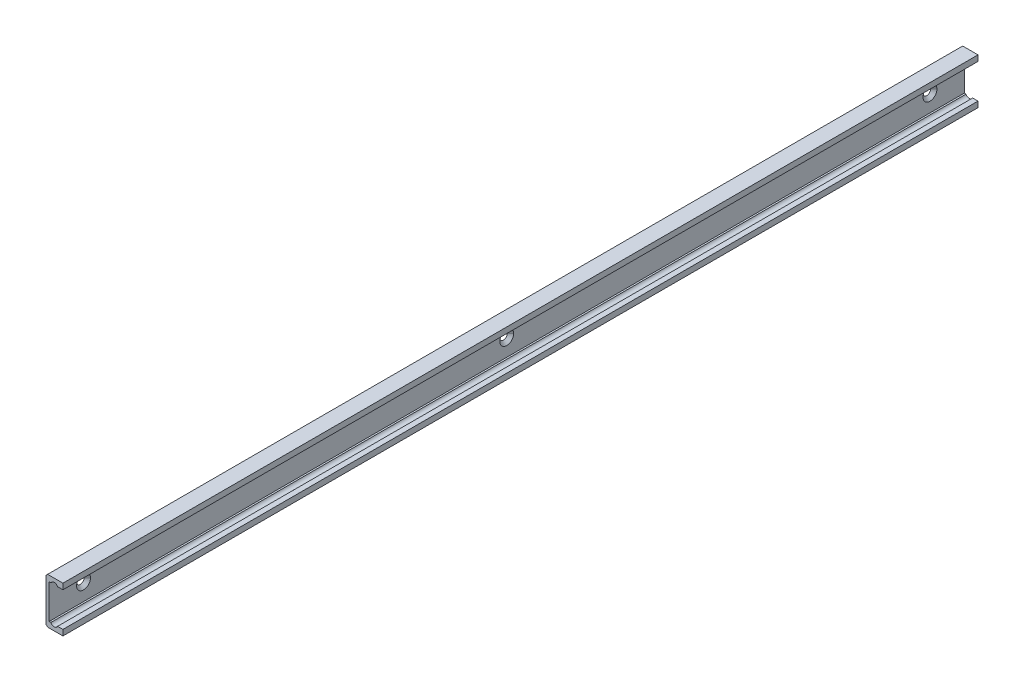
ISO-10303-21;
HEADER;
FILE_DESCRIPTION(('STEP AP214'),'2;1');
FILE_NAME('part.step','',(''),(''),'','','');
FILE_SCHEMA(('AUTOMOTIVE_DESIGN { 1 0 10303 214 1 1 1 1 }'));
ENDSEC;
DATA;
#1=APPLICATION_CONTEXT('core data for automotive mechanical design processes');
#2=APPLICATION_PROTOCOL_DEFINITION('international standard','automotive_design',2000,#1);
#3=PRODUCT_CONTEXT('',#1,'mechanical');
#4=PRODUCT('Part','Part','',(#3));
#5=PRODUCT_RELATED_PRODUCT_CATEGORY('part','',(#4));
#6=PRODUCT_DEFINITION_FORMATION('','',#4);
#7=PRODUCT_DEFINITION_CONTEXT('part definition',#1,'design');
#8=PRODUCT_DEFINITION('design','',#6,#7);
#9=PRODUCT_DEFINITION_SHAPE('','',#8);
#10=(LENGTH_UNIT() NAMED_UNIT(*) SI_UNIT(.MILLI.,.METRE.));
#11=(NAMED_UNIT(*) PLANE_ANGLE_UNIT() SI_UNIT($,.RADIAN.));
#12=(NAMED_UNIT(*) SI_UNIT($,.STERADIAN.) SOLID_ANGLE_UNIT());
#13=UNCERTAINTY_MEASURE_WITH_UNIT(LENGTH_MEASURE(1.E-05),#10,'distance_accuracy_value','');
#14=(GEOMETRIC_REPRESENTATION_CONTEXT(3) GLOBAL_UNCERTAINTY_ASSIGNED_CONTEXT((#13)) GLOBAL_UNIT_ASSIGNED_CONTEXT((#10,
#11,#12)) REPRESENTATION_CONTEXT('',''));
#15=CARTESIAN_POINT('',(0.,0.,0.));
#16=DIRECTION('',(0.,0.,1.));
#17=DIRECTION('',(1.,0.,0.));
#18=AXIS2_PLACEMENT_3D('',#15,#16,#17);
#19=CARTESIAN_POINT('',(-2.3334990623938,17.5,400.));
#20=DIRECTION('',(0.,1.,0.));
#21=DIRECTION('',(0.,0.,1.));
#22=AXIS2_PLACEMENT_3D('',#19,#20,#21);
#23=PLANE('',#22);
#24=DIRECTION('',(1.,0.,0.));
#25=VECTOR('',#24,1.);
#26=CARTESIAN_POINT('',(-2.3334990623938,17.5,0.));
#27=LINE('',#26,#25);
#28=CARTESIAN_POINT('',(-2.3334990623938,17.5,0.));
#29=VERTEX_POINT('',#28);
#30=CARTESIAN_POINT('',(0.,17.5,0.));
#31=VERTEX_POINT('',#30);
#32=EDGE_CURVE('E11',#29,#31,#27,.T.);
#33=ORIENTED_EDGE('',*,*,#32,.T.);
#34=DIRECTION('',(0.,0.,-1.));
#35=VECTOR('',#34,1.);
#36=CARTESIAN_POINT('',(0.,17.5,400.));
#37=LINE('',#36,#35);
#38=CARTESIAN_POINT('',(0.,17.5,400.));
#39=VERTEX_POINT('',#38);
#40=EDGE_CURVE('E25',#39,#31,#37,.T.);
#41=ORIENTED_EDGE('',*,*,#40,.F.);
#42=DIRECTION('',(1.,0.,0.));
#43=VECTOR('',#42,1.);
#44=CARTESIAN_POINT('',(-2.3334990623938,17.5,400.));
#45=LINE('',#44,#43);
#46=CARTESIAN_POINT('',(-2.3334990623938,17.5,400.));
#47=VERTEX_POINT('',#46);
#48=EDGE_CURVE('E373',#47,#39,#45,.T.);
#49=ORIENTED_EDGE('',*,*,#48,.F.);
#50=DIRECTION('',(0.,0.,-1.));
#51=VECTOR('',#50,1.);
#52=CARTESIAN_POINT('',(-2.3334990623938,17.5,400.));
#53=LINE('',#52,#51);
#54=EDGE_CURVE('E369',#47,#29,#53,.T.);
#55=ORIENTED_EDGE('',*,*,#54,.T.);
#56=EDGE_LOOP('',(#33,#41,#49,#55));
#57=FACE_BOUND('',#56,.T.);
#58=ADVANCED_FACE('F17',(#57),#23,.F.);
#59=CARTESIAN_POINT('',(-3.8,16.8000000000001,400.));
#60=DIRECTION('',(0.,0.,1.));
#61=DIRECTION('',(0.,-1.,0.));
#62=AXIS2_PLACEMENT_3D('',#59,#60,#61);
#63=CYLINDRICAL_SURFACE('',#62,1.625);
#64=DIRECTION('',(0.,0.,-1.));
#65=VECTOR('',#64,1.);
#66=CARTESIAN_POINT('',(-5.2665009376062,17.5,400.));
#67=LINE('',#66,#65);
#68=CARTESIAN_POINT('',(-5.2665009376062,17.5,400.));
#69=VERTEX_POINT('',#68);
#70=CARTESIAN_POINT('',(-5.2665009376062,17.5,0.));
#71=VERTEX_POINT('',#70);
#72=EDGE_CURVE('E365',#69,#71,#67,.T.);
#73=ORIENTED_EDGE('',*,*,#72,.T.);
#74=CARTESIAN_POINT('',(-3.8,16.8000000000001,0.));
#75=DIRECTION('',(0.,0.,1.));
#76=DIRECTION('',(1.,0.,0.));
#77=AXIS2_PLACEMENT_3D('',#74,#75,#76);
#78=CIRCLE('',#77,1.625);
#79=EDGE_CURVE('E360',#29,#71,#78,.T.);
#80=ORIENTED_EDGE('',*,*,#79,.F.);
#81=ORIENTED_EDGE('',*,*,#54,.F.);
#82=CARTESIAN_POINT('',(-3.8,16.8000000000001,400.));
#83=DIRECTION('',(0.,0.,1.));
#84=DIRECTION('',(1.,0.,0.));
#85=AXIS2_PLACEMENT_3D('',#82,#83,#84);
#86=CIRCLE('',#85,1.625);
#87=EDGE_CURVE('E356',#47,#69,#86,.T.);
#88=ORIENTED_EDGE('',*,*,#87,.T.);
#89=EDGE_LOOP('',(#73,#80,#81,#88));
#90=FACE_BOUND('',#89,.T.);
#91=ADVANCED_FACE('F458',(#90),#63,.F.);
#92=CARTESIAN_POINT('',(-3.8,3.19999999999993,400.));
#93=DIRECTION('',(0.,0.,1.));
#94=DIRECTION('',(1.,0.,0.));
#95=AXIS2_PLACEMENT_3D('',#92,#93,#94);
#96=PLANE('',#95);
#97=DIRECTION('',(0.,-1.,0.));
#98=VECTOR('',#97,1.);
#99=CARTESIAN_POINT('',(-7.4,19.292893218813,400.));
#100=LINE('',#99,#98);
#101=CARTESIAN_POINT('',(-7.4,19.292893218813,400.));
#102=VERTEX_POINT('',#101);
#103=CARTESIAN_POINT('',(-7.4,0.70710678118655,400.));
#104=VERTEX_POINT('',#103);
#105=EDGE_CURVE('E352',#102,#104,#100,.T.);
#106=ORIENTED_EDGE('',*,*,#105,.T.);
#107=DIRECTION('',(0.707106781186522,-0.707106781186573,0.));
#108=VECTOR('',#107,1.);
#109=CARTESIAN_POINT('',(-7.4,0.70710678118655,400.));
#110=LINE('',#109,#108);
#111=CARTESIAN_POINT('',(-6.6928932188135,0.,400.));
#112=VERTEX_POINT('',#111);
#113=EDGE_CURVE('E348',#104,#112,#110,.T.);
#114=ORIENTED_EDGE('',*,*,#113,.T.);
#115=DIRECTION('',(1.,0.,0.));
#116=VECTOR('',#115,1.);
#117=CARTESIAN_POINT('',(-6.6928932188135,0.,400.));
#118=LINE('',#117,#116);
#119=CARTESIAN_POINT('',(0.,0.,400.));
#120=VERTEX_POINT('',#119);
#121=EDGE_CURVE('E344',#112,#120,#118,.T.);
#122=ORIENTED_EDGE('',*,*,#121,.T.);
#123=DIRECTION('',(0.,1.,0.));
#124=VECTOR('',#123,1.);
#125=CARTESIAN_POINT('',(0.,0.,400.));
#126=LINE('',#125,#124);
#127=CARTESIAN_POINT('',(0.,2.5,400.));
#128=VERTEX_POINT('',#127);
#129=EDGE_CURVE('E340',#120,#128,#126,.T.);
#130=ORIENTED_EDGE('',*,*,#129,.T.);
#131=DIRECTION('',(-1.,0.,0.));
#132=VECTOR('',#131,1.);
#133=CARTESIAN_POINT('',(0.,2.5,400.));
#134=LINE('',#133,#132);
#135=CARTESIAN_POINT('',(-2.3334990623938,2.5,400.));
#136=VERTEX_POINT('',#135);
#137=EDGE_CURVE('E336',#128,#136,#134,.T.);
#138=ORIENTED_EDGE('',*,*,#137,.T.);
#139=CARTESIAN_POINT('',(-3.8,3.19999999999993,400.));
#140=DIRECTION('',(0.,0.,1.));
#141=DIRECTION('',(1.,0.,0.));
#142=AXIS2_PLACEMENT_3D('',#139,#140,#141);
#143=CIRCLE('',#142,1.625);
#144=CARTESIAN_POINT('',(-5.2665009376062,2.5,400.));
#145=VERTEX_POINT('',#144);
#146=EDGE_CURVE('E331',#145,#136,#143,.T.);
#147=ORIENTED_EDGE('',*,*,#146,.F.);
#148=DIRECTION('',(-1.,0.,0.));
#149=VECTOR('',#148,1.);
#150=CARTESIAN_POINT('',(-5.2665009376062,2.5,400.));
#151=LINE('',#150,#149);
#152=CARTESIAN_POINT('',(-6.,2.5,400.));
#153=VERTEX_POINT('',#152);
#154=EDGE_CURVE('E327',#145,#153,#151,.T.);
#155=ORIENTED_EDGE('',*,*,#154,.T.);
#156=DIRECTION('',(0.,1.,0.));
#157=VECTOR('',#156,1.);
#158=CARTESIAN_POINT('',(-6.,2.5,400.));
#159=LINE('',#158,#157);
#160=CARTESIAN_POINT('',(-6.,17.5,400.));
#161=VERTEX_POINT('',#160);
#162=EDGE_CURVE('E323',#153,#161,#159,.T.);
#163=ORIENTED_EDGE('',*,*,#162,.T.);
#164=DIRECTION('',(1.,0.,0.));
#165=VECTOR('',#164,1.);
#166=CARTESIAN_POINT('',(-6.,17.5,400.));
#167=LINE('',#166,#165);
#168=EDGE_CURVE('E318',#161,#69,#167,.T.);
#169=ORIENTED_EDGE('',*,*,#168,.T.);
#170=ORIENTED_EDGE('',*,*,#87,.F.);
#171=ORIENTED_EDGE('',*,*,#48,.T.);
#172=DIRECTION('',(0.,1.,0.));
#173=VECTOR('',#172,1.);
#174=CARTESIAN_POINT('',(0.,17.5,400.));
#175=LINE('',#174,#173);
#176=CARTESIAN_POINT('',(0.,20.,400.));
#177=VERTEX_POINT('',#176);
#178=EDGE_CURVE('E314',#39,#177,#175,.T.);
#179=ORIENTED_EDGE('',*,*,#178,.T.);
#180=DIRECTION('',(-1.,0.,0.));
#181=VECTOR('',#180,1.);
#182=CARTESIAN_POINT('',(0.,20.,400.));
#183=LINE('',#182,#181);
#184=CARTESIAN_POINT('',(-6.6928932188135,20.,400.));
#185=VERTEX_POINT('',#184);
#186=EDGE_CURVE('E310',#177,#185,#183,.T.);
#187=ORIENTED_EDGE('',*,*,#186,.T.);
#188=DIRECTION('',(-0.707106781186298,-0.707106781186797,0.));
#189=VECTOR('',#188,1.);
#190=CARTESIAN_POINT('',(-6.6928932188135,20.,400.));
#191=LINE('',#190,#189);
#192=EDGE_CURVE('E306',#185,#102,#191,.T.);
#193=ORIENTED_EDGE('',*,*,#192,.T.);
#194=EDGE_LOOP('',(#106,#114,#122,#130,#138,#147,#155,#163,#169,#170,#171,#179,#187,#193));
#195=FACE_BOUND('',#194,.T.);
#196=ADVANCED_FACE('F397',(#195),#96,.T.);
#197=CARTESIAN_POINT('',(-6.6928932188135,20.,400.));
#198=DIRECTION('',(0.707106781186797,-0.707106781186298,0.));
#199=DIRECTION('',(0.707106781186298,0.707106781186797,0.));
#200=AXIS2_PLACEMENT_3D('',#197,#198,#199);
#201=PLANE('',#200);
#202=DIRECTION('',(-0.707106781186298,-0.707106781186797,0.));
#203=VECTOR('',#202,1.);
#204=CARTESIAN_POINT('',(-6.6928932188135,20.,0.));
#205=LINE('',#204,#203);
#206=CARTESIAN_POINT('',(-6.6928932188135,20.,0.));
#207=VERTEX_POINT('',#206);
#208=CARTESIAN_POINT('',(-7.4,19.292893218813,0.));
#209=VERTEX_POINT('',#208);
#210=EDGE_CURVE('E302',#207,#209,#205,.T.);
#211=ORIENTED_EDGE('',*,*,#210,.T.);
#212=DIRECTION('',(0.,0.,-1.));
#213=VECTOR('',#212,1.);
#214=CARTESIAN_POINT('',(-7.4,19.292893218813,400.));
#215=LINE('',#214,#213);
#216=EDGE_CURVE('E297',#102,#209,#215,.T.);
#217=ORIENTED_EDGE('',*,*,#216,.F.);
#218=ORIENTED_EDGE('',*,*,#192,.F.);
#219=DIRECTION('',(0.,0.,-1.));
#220=VECTOR('',#219,1.);
#221=CARTESIAN_POINT('',(-6.6928932188135,20.,400.));
#222=LINE('',#221,#220);
#223=EDGE_CURVE('E293',#185,#207,#222,.T.);
#224=ORIENTED_EDGE('',*,*,#223,.T.);
#225=EDGE_LOOP('',(#211,#217,#218,#224));
#226=FACE_BOUND('',#225,.T.);
#227=ADVANCED_FACE('F400',(#226),#201,.F.);
#228=CARTESIAN_POINT('',(0.,20.,400.));
#229=DIRECTION('',(0.,-1.,0.));
#230=DIRECTION('',(0.,0.,-1.));
#231=AXIS2_PLACEMENT_3D('',#228,#229,#230);
#232=PLANE('',#231);
#233=DIRECTION('',(-1.,0.,0.));
#234=VECTOR('',#233,1.);
#235=CARTESIAN_POINT('',(0.,20.,0.));
#236=LINE('',#235,#234);
#237=CARTESIAN_POINT('',(0.,20.,0.));
#238=VERTEX_POINT('',#237);
#239=EDGE_CURVE('E288',#238,#207,#236,.T.);
#240=ORIENTED_EDGE('',*,*,#239,.T.);
#241=ORIENTED_EDGE('',*,*,#223,.F.);
#242=ORIENTED_EDGE('',*,*,#186,.F.);
#243=DIRECTION('',(0.,0.,-1.));
#244=VECTOR('',#243,1.);
#245=CARTESIAN_POINT('',(0.,20.,400.));
#246=LINE('',#245,#244);
#247=EDGE_CURVE('E284',#177,#238,#246,.T.);
#248=ORIENTED_EDGE('',*,*,#247,.T.);
#249=EDGE_LOOP('',(#240,#241,#242,#248));
#250=FACE_BOUND('',#249,.T.);
#251=ADVANCED_FACE('F393',(#250),#232,.F.);
#252=CARTESIAN_POINT('',(0.,17.5,400.));
#253=DIRECTION('',(-1.,0.,0.));
#254=DIRECTION('',(0.,0.,1.));
#255=AXIS2_PLACEMENT_3D('',#252,#253,#254);
#256=PLANE('',#255);
#257=DIRECTION('',(0.,1.,0.));
#258=VECTOR('',#257,1.);
#259=CARTESIAN_POINT('',(0.,17.5,0.));
#260=LINE('',#259,#258);
#261=EDGE_CURVE('E279',#31,#238,#260,.T.);
#262=ORIENTED_EDGE('',*,*,#261,.T.);
#263=ORIENTED_EDGE('',*,*,#247,.F.);
#264=ORIENTED_EDGE('',*,*,#178,.F.);
#265=ORIENTED_EDGE('',*,*,#40,.T.);
#266=EDGE_LOOP('',(#262,#263,#264,#265));
#267=FACE_BOUND('',#266,.T.);
#268=ADVANCED_FACE('F384',(#267),#256,.F.);
#269=CARTESIAN_POINT('',(-3.8,3.19999999999993,0.));
#270=DIRECTION('',(0.,0.,1.));
#271=DIRECTION('',(1.,0.,0.));
#272=AXIS2_PLACEMENT_3D('',#269,#270,#271);
#273=PLANE('',#272);
#274=DIRECTION('',(0.,-1.,0.));
#275=VECTOR('',#274,1.);
#276=CARTESIAN_POINT('',(-7.4,19.292893218813,0.));
#277=LINE('',#276,#275);
#278=CARTESIAN_POINT('',(-7.4,0.70710678118655,0.));
#279=VERTEX_POINT('',#278);
#280=EDGE_CURVE('E274',#209,#279,#277,.T.);
#281=ORIENTED_EDGE('',*,*,#280,.F.);
#282=ORIENTED_EDGE('',*,*,#210,.F.);
#283=ORIENTED_EDGE('',*,*,#239,.F.);
#284=ORIENTED_EDGE('',*,*,#261,.F.);
#285=ORIENTED_EDGE('',*,*,#32,.F.);
#286=ORIENTED_EDGE('',*,*,#79,.T.);
#287=DIRECTION('',(1.,0.,0.));
#288=VECTOR('',#287,1.);
#289=CARTESIAN_POINT('',(-6.,17.5,0.));
#290=LINE('',#289,#288);
#291=CARTESIAN_POINT('',(-6.,17.5,0.));
#292=VERTEX_POINT('',#291);
#293=EDGE_CURVE('E269',#292,#71,#290,.T.);
#294=ORIENTED_EDGE('',*,*,#293,.F.);
#295=DIRECTION('',(0.,1.,0.));
#296=VECTOR('',#295,1.);
#297=CARTESIAN_POINT('',(-6.,2.5,0.));
#298=LINE('',#297,#296);
#299=CARTESIAN_POINT('',(-6.,2.5,0.));
#300=VERTEX_POINT('',#299);
#301=EDGE_CURVE('E264',#300,#292,#298,.T.);
#302=ORIENTED_EDGE('',*,*,#301,.F.);
#303=DIRECTION('',(-1.,0.,0.));
#304=VECTOR('',#303,1.);
#305=CARTESIAN_POINT('',(-5.2665009376062,2.5,0.));
#306=LINE('',#305,#304);
#307=CARTESIAN_POINT('',(-5.2665009376062,2.5,0.));
#308=VERTEX_POINT('',#307);
#309=EDGE_CURVE('E259',#308,#300,#306,.T.);
#310=ORIENTED_EDGE('',*,*,#309,.F.);
#311=CARTESIAN_POINT('',(-3.8,3.19999999999993,0.));
#312=DIRECTION('',(0.,0.,1.));
#313=DIRECTION('',(1.,0.,0.));
#314=AXIS2_PLACEMENT_3D('',#311,#312,#313);
#315=CIRCLE('',#314,1.625);
#316=CARTESIAN_POINT('',(-2.3334990623938,2.5,0.));
#317=VERTEX_POINT('',#316);
#318=EDGE_CURVE('E255',#308,#317,#315,.T.);
#319=ORIENTED_EDGE('',*,*,#318,.T.);
#320=DIRECTION('',(-1.,0.,0.));
#321=VECTOR('',#320,1.);
#322=CARTESIAN_POINT('',(0.,2.5,0.));
#323=LINE('',#322,#321);
#324=CARTESIAN_POINT('',(0.,2.5,0.));
#325=VERTEX_POINT('',#324);
#326=EDGE_CURVE('E250',#325,#317,#323,.T.);
#327=ORIENTED_EDGE('',*,*,#326,.F.);
#328=DIRECTION('',(0.,1.,0.));
#329=VECTOR('',#328,1.);
#330=CARTESIAN_POINT('',(0.,0.,0.));
#331=LINE('',#330,#329);
#332=CARTESIAN_POINT('',(0.,0.,0.));
#333=VERTEX_POINT('',#332);
#334=EDGE_CURVE('E245',#333,#325,#331,.T.);
#335=ORIENTED_EDGE('',*,*,#334,.F.);
#336=DIRECTION('',(1.,0.,0.));
#337=VECTOR('',#336,1.);
#338=CARTESIAN_POINT('',(-6.6928932188135,0.,0.));
#339=LINE('',#338,#337);
#340=CARTESIAN_POINT('',(-6.6928932188135,0.,0.));
#341=VERTEX_POINT('',#340);
#342=EDGE_CURVE('E240',#341,#333,#339,.T.);
#343=ORIENTED_EDGE('',*,*,#342,.F.);
#344=DIRECTION('',(0.707106781186522,-0.707106781186573,0.));
#345=VECTOR('',#344,1.);
#346=CARTESIAN_POINT('',(-7.4,0.70710678118655,0.));
#347=LINE('',#346,#345);
#348=EDGE_CURVE('E235',#279,#341,#347,.T.);
#349=ORIENTED_EDGE('',*,*,#348,.F.);
#350=EDGE_LOOP('',(#281,#282,#283,#284,#285,#286,#294,#302,#310,#319,#327,#335,#343,#349));
#351=FACE_BOUND('',#350,.T.);
#352=ADVANCED_FACE('F389',(#351),#273,.F.);
#353=CARTESIAN_POINT('',(-7.4,0.70710678118655,400.));
#354=DIRECTION('',(0.707106781186573,0.707106781186522,0.));
#355=DIRECTION('',(-0.707106781186522,0.707106781186573,0.));
#356=AXIS2_PLACEMENT_3D('',#353,#354,#355);
#357=PLANE('',#356);
#358=ORIENTED_EDGE('',*,*,#348,.T.);
#359=DIRECTION('',(0.,0.,-1.));
#360=VECTOR('',#359,1.);
#361=CARTESIAN_POINT('',(-6.6928932188135,0.,400.));
#362=LINE('',#361,#360);
#363=EDGE_CURVE('E230',#112,#341,#362,.T.);
#364=ORIENTED_EDGE('',*,*,#363,.F.);
#365=ORIENTED_EDGE('',*,*,#113,.F.);
#366=DIRECTION('',(0.,0.,-1.));
#367=VECTOR('',#366,1.);
#368=CARTESIAN_POINT('',(-7.4,0.70710678118655,400.));
#369=LINE('',#368,#367);
#370=EDGE_CURVE('E225',#104,#279,#369,.T.);
#371=ORIENTED_EDGE('',*,*,#370,.T.);
#372=EDGE_LOOP('',(#358,#364,#365,#371));
#373=FACE_BOUND('',#372,.T.);
#374=ADVANCED_FACE('F408',(#373),#357,.F.);
#375=CARTESIAN_POINT('',(-7.4,19.292893218813,400.));
#376=DIRECTION('',(1.,0.,0.));
#377=DIRECTION('',(0.,0.,-1.));
#378=AXIS2_PLACEMENT_3D('',#375,#376,#377);
#379=PLANE('',#378);
#380=CARTESIAN_POINT('',(-7.4,10.,385.));
#381=DIRECTION('',(1.,0.,0.));
#382=DIRECTION('',(0.,0.,-1.));
#383=AXIS2_PLACEMENT_3D('',#380,#381,#382);
#384=CIRCLE('',#383,1.65);
#385=CARTESIAN_POINT('',(-7.4,10.,383.35));
#386=VERTEX_POINT('',#385);
#387=CARTESIAN_POINT('',(-7.40000000000001,10.,386.65));
#388=VERTEX_POINT('',#387);
#389=EDGE_CURVE('E221',#386,#388,#384,.T.);
#390=ORIENTED_EDGE('',*,*,#389,.T.);
#391=CARTESIAN_POINT('',(-7.4,10.,385.));
#392=DIRECTION('',(1.,0.,0.));
#393=DIRECTION('',(0.,0.,-1.));
#394=AXIS2_PLACEMENT_3D('',#391,#392,#393);
#395=CIRCLE('',#394,1.65);
#396=EDGE_CURVE('E217',#388,#386,#395,.T.);
#397=ORIENTED_EDGE('',*,*,#396,.T.);
#398=EDGE_LOOP('',(#390,#397));
#399=FACE_BOUND('',#398,.T.);
#400=CARTESIAN_POINT('',(-7.4,10.,200.));
#401=DIRECTION('',(1.,0.,0.));
#402=DIRECTION('',(0.,0.,-1.));
#403=AXIS2_PLACEMENT_3D('',#400,#401,#402);
#404=CIRCLE('',#403,1.65);
#405=CARTESIAN_POINT('',(-7.4,10.,198.35));
#406=VERTEX_POINT('',#405);
#407=CARTESIAN_POINT('',(-7.4,10.,201.65));
#408=VERTEX_POINT('',#407);
#409=EDGE_CURVE('E213',#406,#408,#404,.T.);
#410=ORIENTED_EDGE('',*,*,#409,.T.);
#411=CARTESIAN_POINT('',(-7.4,10.,200.));
#412=DIRECTION('',(1.,0.,0.));
#413=DIRECTION('',(0.,0.,-1.));
#414=AXIS2_PLACEMENT_3D('',#411,#412,#413);
#415=CIRCLE('',#414,1.65);
#416=EDGE_CURVE('E163',#408,#406,#415,.T.);
#417=ORIENTED_EDGE('',*,*,#416,.T.);
#418=EDGE_LOOP('',(#410,#417));
#419=FACE_BOUND('',#418,.T.);
#420=CARTESIAN_POINT('',(-7.4,10.,15.));
#421=DIRECTION('',(1.,0.,0.));
#422=DIRECTION('',(0.,0.,-1.));
#423=AXIS2_PLACEMENT_3D('',#420,#421,#422);
#424=CIRCLE('',#423,1.65);
#425=CARTESIAN_POINT('',(-7.4,10.,13.35));
#426=VERTEX_POINT('',#425);
#427=CARTESIAN_POINT('',(-7.4,10.,16.65));
#428=VERTEX_POINT('',#427);
#429=EDGE_CURVE('E206',#426,#428,#424,.T.);
#430=ORIENTED_EDGE('',*,*,#429,.T.);
#431=CARTESIAN_POINT('',(-7.4,10.,15.));
#432=DIRECTION('',(1.,0.,0.));
#433=DIRECTION('',(0.,0.,-1.));
#434=AXIS2_PLACEMENT_3D('',#431,#432,#433);
#435=CIRCLE('',#434,1.65);
#436=EDGE_CURVE('E202',#428,#426,#435,.T.);
#437=ORIENTED_EDGE('',*,*,#436,.T.);
#438=EDGE_LOOP('',(#430,#437));
#439=FACE_BOUND('',#438,.T.);
#440=ORIENTED_EDGE('',*,*,#280,.T.);
#441=ORIENTED_EDGE('',*,*,#370,.F.);
#442=ORIENTED_EDGE('',*,*,#105,.F.);
#443=ORIENTED_EDGE('',*,*,#216,.T.);
#444=EDGE_LOOP('',(#440,#441,#442,#443));
#445=FACE_BOUND('',#444,.T.);
#446=ADVANCED_FACE('F404',(#399,#419,#439,#445),#379,.F.);
#447=CARTESIAN_POINT('',(-7.4,10.,15.));
#448=DIRECTION('',(1.,0.,0.));
#449=DIRECTION('',(0.,1.,0.));
#450=AXIS2_PLACEMENT_3D('',#447,#448,#449);
#451=CONICAL_SURFACE('',#450,1.65,0.7853981634);
#452=ORIENTED_EDGE('',*,*,#436,.F.);
#453=DIRECTION('',(0.707106781184743,0.,0.707106781188352));
#454=VECTOR('',#453,1.);
#455=CARTESIAN_POINT('',(-7.4,10.,16.65));
#456=LINE('',#455,#454);
#457=CARTESIAN_POINT('',(-6.00000000000357,10.,18.0500000000036));
#458=VERTEX_POINT('',#457);
#459=EDGE_CURVE('E198',#428,#458,#456,.T.);
#460=ORIENTED_EDGE('',*,*,#459,.T.);
#461=CARTESIAN_POINT('',(-6.,10.,15.));
#462=DIRECTION('',(1.,0.,0.));
#463=DIRECTION('',(0.,0.,-1.));
#464=AXIS2_PLACEMENT_3D('',#461,#462,#463);
#465=CIRCLE('',#464,3.05);
#466=CARTESIAN_POINT('',(-6.,10.,11.95));
#467=VERTEX_POINT('',#466);
#468=EDGE_CURVE('E194',#458,#467,#465,.T.);
#469=ORIENTED_EDGE('',*,*,#468,.T.);
#470=DIRECTION('',(0.707106781184743,0.,-0.707106781188352));
#471=VECTOR('',#470,1.);
#472=CARTESIAN_POINT('',(-7.4,10.,13.35));
#473=LINE('',#472,#471);
#474=EDGE_CURVE('E189',#426,#467,#473,.T.);
#475=ORIENTED_EDGE('',*,*,#474,.F.);
#476=EDGE_LOOP('',(#452,#460,#469,#475));
#477=FACE_BOUND('',#476,.T.);
#478=ADVANCED_FACE('F499',(#477),#451,.F.);
#479=CARTESIAN_POINT('',(-7.4,10.,15.));
#480=DIRECTION('',(1.,0.,0.));
#481=DIRECTION('',(0.,-1.,0.));
#482=AXIS2_PLACEMENT_3D('',#479,#480,#481);
#483=CONICAL_SURFACE('',#482,1.65,0.7853981634);
#484=CARTESIAN_POINT('',(-6.,10.,15.));
#485=DIRECTION('',(1.,0.,0.));
#486=DIRECTION('',(0.,0.,-1.));
#487=AXIS2_PLACEMENT_3D('',#484,#485,#486);
#488=CIRCLE('',#487,3.05);
#489=EDGE_CURVE('E184',#467,#458,#488,.T.);
#490=ORIENTED_EDGE('',*,*,#489,.T.);
#491=ORIENTED_EDGE('',*,*,#459,.F.);
#492=ORIENTED_EDGE('',*,*,#429,.F.);
#493=ORIENTED_EDGE('',*,*,#474,.T.);
#494=EDGE_LOOP('',(#490,#491,#492,#493));
#495=FACE_BOUND('',#494,.T.);
#496=ADVANCED_FACE('F503',(#495),#483,.F.);
#497=CARTESIAN_POINT('',(-6.,2.5,400.));
#498=DIRECTION('',(-1.,0.,0.));
#499=DIRECTION('',(0.,0.,1.));
#500=AXIS2_PLACEMENT_3D('',#497,#498,#499);
#501=PLANE('',#500);
#502=CARTESIAN_POINT('',(-6.,10.,385.));
#503=DIRECTION('',(1.,0.,0.));
#504=DIRECTION('',(0.,0.,-1.));
#505=AXIS2_PLACEMENT_3D('',#502,#503,#504);
#506=CIRCLE('',#505,3.05);
#507=CARTESIAN_POINT('',(-6.,10.,381.95));
#508=VERTEX_POINT('',#507);
#509=CARTESIAN_POINT('',(-6.00000000000357,10.,388.050000000004));
#510=VERTEX_POINT('',#509);
#511=EDGE_CURVE('E173',#508,#510,#506,.T.);
#512=ORIENTED_EDGE('',*,*,#511,.F.);
#513=CARTESIAN_POINT('',(-6.,10.,385.));
#514=DIRECTION('',(1.,0.,0.));
#515=DIRECTION('',(0.,0.,-1.));
#516=AXIS2_PLACEMENT_3D('',#513,#514,#515);
#517=CIRCLE('',#516,3.05);
#518=EDGE_CURVE('E170',#510,#508,#517,.T.);
#519=ORIENTED_EDGE('',*,*,#518,.F.);
#520=EDGE_LOOP('',(#512,#519));
#521=FACE_BOUND('',#520,.T.);
#522=CARTESIAN_POINT('',(-6.,10.,200.));
#523=DIRECTION('',(1.,0.,0.));
#524=DIRECTION('',(0.,0.,-1.));
#525=AXIS2_PLACEMENT_3D('',#522,#523,#524);
#526=CIRCLE('',#525,3.05);
#527=CARTESIAN_POINT('',(-6.,10.,196.95));
#528=VERTEX_POINT('',#527);
#529=CARTESIAN_POINT('',(-6.00000000000357,10.,203.050000000004));
#530=VERTEX_POINT('',#529);
#531=EDGE_CURVE('E153',#528,#530,#526,.T.);
#532=ORIENTED_EDGE('',*,*,#531,.F.);
#533=CARTESIAN_POINT('',(-6.,10.,200.));
#534=DIRECTION('',(1.,0.,0.));
#535=DIRECTION('',(0.,0.,-1.));
#536=AXIS2_PLACEMENT_3D('',#533,#534,#535);
#537=CIRCLE('',#536,3.05);
#538=EDGE_CURVE('E148',#530,#528,#537,.T.);
#539=ORIENTED_EDGE('',*,*,#538,.F.);
#540=EDGE_LOOP('',(#532,#539));
#541=FACE_BOUND('',#540,.T.);
#542=ORIENTED_EDGE('',*,*,#489,.F.);
#543=ORIENTED_EDGE('',*,*,#468,.F.);
#544=EDGE_LOOP('',(#542,#543));
#545=FACE_BOUND('',#544,.T.);
#546=ORIENTED_EDGE('',*,*,#301,.T.);
#547=DIRECTION('',(0.,0.,-1.));
#548=VECTOR('',#547,1.);
#549=CARTESIAN_POINT('',(-6.,17.5,400.));
#550=LINE('',#549,#548);
#551=EDGE_CURVE('E157',#161,#292,#550,.T.);
#552=ORIENTED_EDGE('',*,*,#551,.F.);
#553=ORIENTED_EDGE('',*,*,#162,.F.);
#554=DIRECTION('',(0.,0.,-1.));
#555=VECTOR('',#554,1.);
#556=CARTESIAN_POINT('',(-6.,2.5,400.));
#557=LINE('',#556,#555);
#558=EDGE_CURVE('E437',#153,#300,#557,.T.);
#559=ORIENTED_EDGE('',*,*,#558,.T.);
#560=EDGE_LOOP('',(#546,#552,#553,#559));
#561=FACE_BOUND('',#560,.T.);
#562=ADVANCED_FACE('F150',(#521,#541,#545,#561),#501,.F.);
#563=CARTESIAN_POINT('',(-5.2665009376062,2.5,400.));
#564=DIRECTION('',(0.,-1.,0.));
#565=DIRECTION('',(0.,0.,-1.));
#566=AXIS2_PLACEMENT_3D('',#563,#564,#565);
#567=PLANE('',#566);
#568=ORIENTED_EDGE('',*,*,#309,.T.);
#569=ORIENTED_EDGE('',*,*,#558,.F.);
#570=ORIENTED_EDGE('',*,*,#154,.F.);
#571=DIRECTION('',(0.,0.,-1.));
#572=VECTOR('',#571,1.);
#573=CARTESIAN_POINT('',(-5.2665009376062,2.5,400.));
#574=LINE('',#573,#572);
#575=EDGE_CURVE('E425',#145,#308,#574,.T.);
#576=ORIENTED_EDGE('',*,*,#575,.T.);
#577=EDGE_LOOP('',(#568,#569,#570,#576));
#578=FACE_BOUND('',#577,.T.);
#579=ADVANCED_FACE('F463',(#578),#567,.F.);
#580=CARTESIAN_POINT('',(-3.8,3.19999999999993,400.));
#581=DIRECTION('',(0.,0.,1.));
#582=DIRECTION('',(0.,1.,0.));
#583=AXIS2_PLACEMENT_3D('',#580,#581,#582);
#584=CYLINDRICAL_SURFACE('',#583,1.625);
#585=DIRECTION('',(0.,0.,-1.));
#586=VECTOR('',#585,1.);
#587=CARTESIAN_POINT('',(-2.3334990623938,2.5,400.));
#588=LINE('',#587,#586);
#589=EDGE_CURVE('E422',#136,#317,#588,.T.);
#590=ORIENTED_EDGE('',*,*,#589,.T.);
#591=ORIENTED_EDGE('',*,*,#318,.F.);
#592=ORIENTED_EDGE('',*,*,#575,.F.);
#593=ORIENTED_EDGE('',*,*,#146,.T.);
#594=EDGE_LOOP('',(#590,#591,#592,#593));
#595=FACE_BOUND('',#594,.T.);
#596=ADVANCED_FACE('F466',(#595),#584,.F.);
#597=CARTESIAN_POINT('',(0.,2.5,400.));
#598=DIRECTION('',(0.,-1.,0.));
#599=DIRECTION('',(0.,0.,-1.));
#600=AXIS2_PLACEMENT_3D('',#597,#598,#599);
#601=PLANE('',#600);
#602=ORIENTED_EDGE('',*,*,#326,.T.);
#603=ORIENTED_EDGE('',*,*,#589,.F.);
#604=ORIENTED_EDGE('',*,*,#137,.F.);
#605=DIRECTION('',(0.,0.,-1.));
#606=VECTOR('',#605,1.);
#607=CARTESIAN_POINT('',(0.,2.5,400.));
#608=LINE('',#607,#606);
#609=EDGE_CURVE('E420',#128,#325,#608,.T.);
#610=ORIENTED_EDGE('',*,*,#609,.T.);
#611=EDGE_LOOP('',(#602,#603,#604,#610));
#612=FACE_BOUND('',#611,.T.);
#613=ADVANCED_FACE('F468',(#612),#601,.F.);
#614=CARTESIAN_POINT('',(0.,0.,400.));
#615=DIRECTION('',(-1.,0.,0.));
#616=DIRECTION('',(0.,0.,1.));
#617=AXIS2_PLACEMENT_3D('',#614,#615,#616);
#618=PLANE('',#617);
#619=ORIENTED_EDGE('',*,*,#334,.T.);
#620=ORIENTED_EDGE('',*,*,#609,.F.);
#621=ORIENTED_EDGE('',*,*,#129,.F.);
#622=DIRECTION('',(0.,0.,-1.));
#623=VECTOR('',#622,1.);
#624=CARTESIAN_POINT('',(0.,0.,400.));
#625=LINE('',#624,#623);
#626=EDGE_CURVE('E166',#120,#333,#625,.T.);
#627=ORIENTED_EDGE('',*,*,#626,.T.);
#628=EDGE_LOOP('',(#619,#620,#621,#627));
#629=FACE_BOUND('',#628,.T.);
#630=ADVANCED_FACE('F418',(#629),#618,.F.);
#631=CARTESIAN_POINT('',(-6.6928932188135,0.,400.));
#632=DIRECTION('',(0.,1.,0.));
#633=DIRECTION('',(0.,0.,1.));
#634=AXIS2_PLACEMENT_3D('',#631,#632,#633);
#635=PLANE('',#634);
#636=ORIENTED_EDGE('',*,*,#342,.T.);
#637=ORIENTED_EDGE('',*,*,#626,.F.);
#638=ORIENTED_EDGE('',*,*,#121,.F.);
#639=ORIENTED_EDGE('',*,*,#363,.T.);
#640=EDGE_LOOP('',(#636,#637,#638,#639));
#641=FACE_BOUND('',#640,.T.);
#642=ADVANCED_FACE('F412',(#641),#635,.F.);
#643=CARTESIAN_POINT('',(-6.,17.5,400.));
#644=DIRECTION('',(0.,1.,0.));
#645=DIRECTION('',(0.,0.,1.));
#646=AXIS2_PLACEMENT_3D('',#643,#644,#645);
#647=PLANE('',#646);
#648=ORIENTED_EDGE('',*,*,#293,.T.);
#649=ORIENTED_EDGE('',*,*,#72,.F.);
#650=ORIENTED_EDGE('',*,*,#168,.F.);
#651=ORIENTED_EDGE('',*,*,#551,.T.);
#652=EDGE_LOOP('',(#648,#649,#650,#651));
#653=FACE_BOUND('',#652,.T.);
#654=ADVANCED_FACE('F450',(#653),#647,.F.);
#655=CARTESIAN_POINT('',(-7.4,10.,200.));
#656=DIRECTION('',(1.,0.,0.));
#657=DIRECTION('',(0.,1.,0.));
#658=AXIS2_PLACEMENT_3D('',#655,#656,#657);
#659=CONICAL_SURFACE('',#658,1.65,0.7853981634);
#660=ORIENTED_EDGE('',*,*,#416,.F.);
#661=DIRECTION('',(0.707106781184733,0.,0.707106781188362));
#662=VECTOR('',#661,1.);
#663=CARTESIAN_POINT('',(-7.4,10.,201.65));
#664=LINE('',#663,#662);
#665=EDGE_CURVE('E161',#408,#530,#664,.T.);
#666=ORIENTED_EDGE('',*,*,#665,.T.);
#667=ORIENTED_EDGE('',*,*,#538,.T.);
#668=DIRECTION('',(0.707106781184733,0.,-0.707106781188362));
#669=VECTOR('',#668,1.);
#670=CARTESIAN_POINT('',(-7.4,10.,198.35));
#671=LINE('',#670,#669);
#672=EDGE_CURVE('E167',#406,#528,#671,.T.);
#673=ORIENTED_EDGE('',*,*,#672,.F.);
#674=EDGE_LOOP('',(#660,#666,#667,#673));
#675=FACE_BOUND('',#674,.T.);
#676=ADVANCED_FACE('F162',(#675),#659,.F.);
#677=CARTESIAN_POINT('',(-7.4,10.,200.));
#678=DIRECTION('',(1.,0.,0.));
#679=DIRECTION('',(0.,-1.,0.));
#680=AXIS2_PLACEMENT_3D('',#677,#678,#679);
#681=CONICAL_SURFACE('',#680,1.65,0.7853981634);
#682=ORIENTED_EDGE('',*,*,#531,.T.);
#683=ORIENTED_EDGE('',*,*,#665,.F.);
#684=ORIENTED_EDGE('',*,*,#409,.F.);
#685=ORIENTED_EDGE('',*,*,#672,.T.);
#686=EDGE_LOOP('',(#682,#683,#684,#685));
#687=FACE_BOUND('',#686,.T.);
#688=ADVANCED_FACE('F169',(#687),#681,.F.);
#689=CARTESIAN_POINT('',(-7.4,10.,385.));
#690=DIRECTION('',(1.,0.,0.));
#691=DIRECTION('',(0.,1.,0.));
#692=AXIS2_PLACEMENT_3D('',#689,#690,#691);
#693=CONICAL_SURFACE('',#692,1.65,0.7853981634);
#694=ORIENTED_EDGE('',*,*,#396,.F.);
#695=DIRECTION('',(0.707106781184766,0.,0.707106781188329));
#696=VECTOR('',#695,1.);
#697=CARTESIAN_POINT('',(-7.40000000000001,10.,386.65));
#698=LINE('',#697,#696);
#699=EDGE_CURVE('E711',#388,#510,#698,.T.);
#700=ORIENTED_EDGE('',*,*,#699,.T.);
#701=ORIENTED_EDGE('',*,*,#518,.T.);
#702=DIRECTION('',(0.707106781184766,0.,-0.707106781188329));
#703=VECTOR('',#702,1.);
#704=CARTESIAN_POINT('',(-7.40000000000001,10.,383.35));
#705=LINE('',#704,#703);
#706=EDGE_CURVE('E713',#386,#508,#705,.T.);
#707=ORIENTED_EDGE('',*,*,#706,.F.);
#708=EDGE_LOOP('',(#694,#700,#701,#707));
#709=FACE_BOUND('',#708,.T.);
#710=ADVANCED_FACE('F567',(#709),#693,.F.);
#711=CARTESIAN_POINT('',(-7.4,10.,385.));
#712=DIRECTION('',(1.,0.,0.));
#713=DIRECTION('',(0.,-1.,0.));
#714=AXIS2_PLACEMENT_3D('',#711,#712,#713);
#715=CONICAL_SURFACE('',#714,1.65,0.7853981634);
#716=ORIENTED_EDGE('',*,*,#511,.T.);
#717=ORIENTED_EDGE('',*,*,#699,.F.);
#718=ORIENTED_EDGE('',*,*,#389,.F.);
#719=ORIENTED_EDGE('',*,*,#706,.T.);
#720=EDGE_LOOP('',(#716,#717,#718,#719));
#721=FACE_BOUND('',#720,.T.);
#722=ADVANCED_FACE('F576',(#721),#715,.F.);
#723=CLOSED_SHELL('',(#58,#91,#196,#227,#251,#268,#352,#374,#446,#478,#496,#562,#579,#596,#613,
#630,#642,#654,#676,#688,#710,#722));
#724=MANIFOLD_SOLID_BREP('B1',#723);
#725=ADVANCED_BREP_SHAPE_REPRESENTATION('',(#18,#724),#14);
#726=SHAPE_DEFINITION_REPRESENTATION(#9,#725);
ENDSEC;
END-ISO-10303-21;
